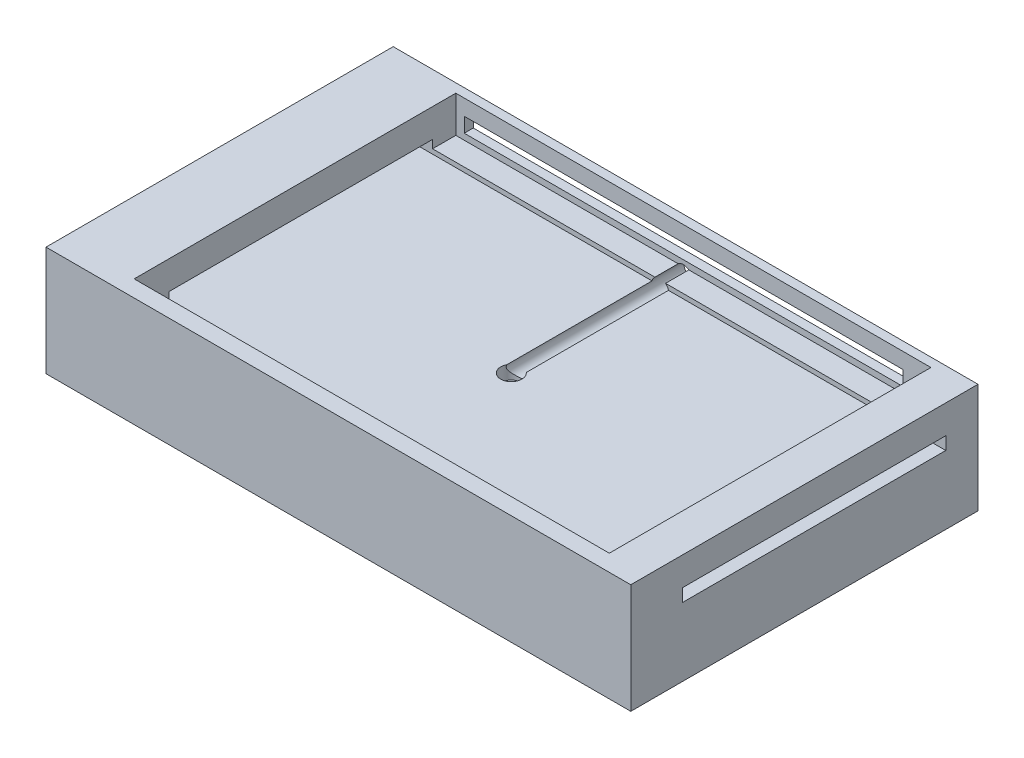
ISO-10303-21;
HEADER;
FILE_DESCRIPTION(('STEP AP214'),'2;1');
FILE_NAME('part.step','',(''),(''),'','','');
FILE_SCHEMA(('AUTOMOTIVE_DESIGN { 1 0 10303 214 1 1 1 1 }'));
ENDSEC;
DATA;
#1=APPLICATION_CONTEXT('core data for automotive mechanical design processes');
#2=APPLICATION_PROTOCOL_DEFINITION('international standard','automotive_design',2000,#1);
#3=PRODUCT_CONTEXT('',#1,'mechanical');
#4=PRODUCT('Part','Part','',(#3));
#5=PRODUCT_RELATED_PRODUCT_CATEGORY('part','',(#4));
#6=PRODUCT_DEFINITION_FORMATION('','',#4);
#7=PRODUCT_DEFINITION_CONTEXT('part definition',#1,'design');
#8=PRODUCT_DEFINITION('design','',#6,#7);
#9=PRODUCT_DEFINITION_SHAPE('','',#8);
#10=(LENGTH_UNIT() NAMED_UNIT(*) SI_UNIT(.MILLI.,.METRE.));
#11=(NAMED_UNIT(*) PLANE_ANGLE_UNIT() SI_UNIT($,.RADIAN.));
#12=(NAMED_UNIT(*) SI_UNIT($,.STERADIAN.) SOLID_ANGLE_UNIT());
#13=UNCERTAINTY_MEASURE_WITH_UNIT(LENGTH_MEASURE(1.E-05),#10,'distance_accuracy_value','');
#14=(GEOMETRIC_REPRESENTATION_CONTEXT(3) GLOBAL_UNCERTAINTY_ASSIGNED_CONTEXT((#13)) GLOBAL_UNIT_ASSIGNED_CONTEXT((#10,
#11,#12)) REPRESENTATION_CONTEXT('',''));
#15=CARTESIAN_POINT('',(0.,0.,0.));
#16=DIRECTION('',(0.,0.,1.));
#17=DIRECTION('',(1.,0.,0.));
#18=AXIS2_PLACEMENT_3D('',#15,#16,#17);
#19=CARTESIAN_POINT('',(0.,20.,0.));
#20=DIRECTION('',(0.,-1.,0.));
#21=DIRECTION('',(0.,0.,-1.));
#22=AXIS2_PLACEMENT_3D('',#19,#20,#21);
#23=PLANE('',#22);
#24=DIRECTION('',(1.,0.,0.));
#25=VECTOR('',#24,1.);
#26=CARTESIAN_POINT('',(0.,20.,-24.206272491128));
#27=LINE('',#26,#25);
#28=CARTESIAN_POINT('',(-60.6525714232133,20.,-24.206272491128));
#29=VERTEX_POINT('',#28);
#30=CARTESIAN_POINT('',(0.175411680552622,20.,-24.206272491128));
#31=VERTEX_POINT('',#30);
#32=EDGE_CURVE('E232',#29,#31,#27,.T.);
#33=ORIENTED_EDGE('',*,*,#32,.T.);
#34=DIRECTION('',(0.,0.,-1.));
#35=VECTOR('',#34,1.);
#36=CARTESIAN_POINT('',(0.175411680552622,20.,16.9774990782962));
#37=LINE('',#36,#35);
#38=CARTESIAN_POINT('',(0.175411680552622,20.,-30.5590778815483));
#39=VERTEX_POINT('',#38);
#40=EDGE_CURVE('E437',#31,#39,#37,.T.);
#41=ORIENTED_EDGE('',*,*,#40,.T.);
#42=DIRECTION('',(-1.,0.,0.));
#43=VECTOR('',#42,1.);
#44=CARTESIAN_POINT('',(-60.6525714232133,20.,-30.5590778815483));
#45=LINE('',#44,#43);
#46=CARTESIAN_POINT('',(-60.6525714232133,20.,-30.5590778815483));
#47=VERTEX_POINT('',#46);
#48=EDGE_CURVE('E338',#39,#47,#45,.T.);
#49=ORIENTED_EDGE('',*,*,#48,.T.);
#50=DIRECTION('',(0.,0.,1.));
#51=VECTOR('',#50,1.);
#52=CARTESIAN_POINT('',(-60.6525714232133,20.,57.4409221184517));
#53=LINE('',#52,#51);
#54=EDGE_CURVE('E329',#47,#29,#53,.T.);
#55=ORIENTED_EDGE('',*,*,#54,.T.);
#56=EDGE_LOOP('',(#33,#41,#49,#55));
#57=FACE_BOUND('',#56,.T.);
#58=ADVANCED_FACE('F39',(#57),#23,.F.);
#59=CARTESIAN_POINT('',(-80.2367335244583,22.2225688530647,-24.206272491128));
#60=DIRECTION('',(0.,0.,-1.));
#61=DIRECTION('',(-1.,0.,0.));
#62=AXIS2_PLACEMENT_3D('',#59,#60,#61);
#63=PLANE('',#62);
#64=DIRECTION('',(1.,0.,0.));
#65=VECTOR('',#64,1.);
#66=CARTESIAN_POINT('',(-80.2367335244583,18.7225688530647,-24.206272491128));
#67=LINE('',#66,#65);
#68=CARTESIAN_POINT('',(-80.2367335244583,18.7225688530647,-24.206272491128));
#69=VERTEX_POINT('',#68);
#70=CARTESIAN_POINT('',(-0.608205941388094,18.7225688530647,-24.206272491128));
#71=VERTEX_POINT('',#70);
#72=EDGE_CURVE('E397',#69,#71,#67,.T.);
#73=ORIENTED_EDGE('',*,*,#72,.T.);
#74=CARTESIAN_POINT('',(1.63716246487507,18.2242509624013,-24.206272491128));
#75=DIRECTION('',(0.,0.,-1.));
#76=DIRECTION('',(-1.,0.,0.));
#77=AXIS2_PLACEMENT_3D('',#74,#75,#76);
#78=CIRCLE('',#77,2.29999999999999);
#79=EDGE_CURVE('E219',#71,#31,#78,.T.);
#80=ORIENTED_EDGE('',*,*,#79,.T.);
#81=ORIENTED_EDGE('',*,*,#32,.F.);
#82=DIRECTION('',(0.,-1.,0.));
#83=VECTOR('',#82,1.);
#84=CARTESIAN_POINT('',(-60.6525714232133,20.,-24.206272491128));
#85=LINE('',#84,#83);
#86=CARTESIAN_POINT('',(-60.6525714232133,22.2225688530647,-24.206272491128));
#87=VERTEX_POINT('',#86);
#88=EDGE_CURVE('E386',#87,#29,#85,.T.);
#89=ORIENTED_EDGE('',*,*,#88,.F.);
#90=DIRECTION('',(1.,0.,0.));
#91=VECTOR('',#90,1.);
#92=CARTESIAN_POINT('',(-80.2367335244583,22.2225688530647,-24.206272491128));
#93=LINE('',#92,#91);
#94=CARTESIAN_POINT('',(-80.2367335244583,22.2225688530647,-24.206272491128));
#95=VERTEX_POINT('',#94);
#96=EDGE_CURVE('E401',#95,#87,#93,.T.);
#97=ORIENTED_EDGE('',*,*,#96,.F.);
#98=DIRECTION('',(0.,1.,0.));
#99=VECTOR('',#98,1.);
#100=CARTESIAN_POINT('',(-80.2367335244583,22.2225688530647,-24.206272491128));
#101=LINE('',#100,#99);
#102=EDGE_CURVE('E67',#69,#95,#101,.T.);
#103=ORIENTED_EDGE('',*,*,#102,.F.);
#104=EDGE_LOOP('',(#73,#80,#81,#89,#97,#103));
#105=FACE_BOUND('',#104,.T.);
#106=ADVANCED_FACE('F471',(#105),#63,.F.);
#107=DIRECTION('',(0.,0.,-1.));
#108=VECTOR('',#107,1.);
#109=CARTESIAN_POINT('',(69.3474285767867,20.,57.4409221184517));
#110=LINE('',#109,#108);
#111=CARTESIAN_POINT('',(69.3474285767867,20.,57.4409221184517));
#112=VERTEX_POINT('',#111);
#113=CARTESIAN_POINT('',(69.3474285767867,20.,47.853119348872));
#114=VERTEX_POINT('',#113);
#115=EDGE_CURVE('E339',#112,#114,#110,.T.);
#116=ORIENTED_EDGE('',*,*,#115,.T.);
#117=DIRECTION('',(-1.,0.,0.));
#118=VECTOR('',#117,1.);
#119=CARTESIAN_POINT('',(0.,20.,47.853119348872));
#120=LINE('',#119,#118);
#121=CARTESIAN_POINT('',(-60.6525714232133,20.,47.853119348872));
#122=VERTEX_POINT('',#121);
#123=EDGE_CURVE('E228',#114,#122,#120,.T.);
#124=ORIENTED_EDGE('',*,*,#123,.T.);
#125=CARTESIAN_POINT('',(-60.6525714232133,20.,57.4409221184517));
#126=VERTEX_POINT('',#125);
#127=EDGE_CURVE('E333',#122,#126,#53,.T.);
#128=ORIENTED_EDGE('',*,*,#127,.T.);
#129=DIRECTION('',(1.,0.,0.));
#130=VECTOR('',#129,1.);
#131=CARTESIAN_POINT('',(-60.6525714232133,20.,57.4409221184517));
#132=LINE('',#131,#130);
#133=EDGE_CURVE('E301',#126,#112,#132,.T.);
#134=ORIENTED_EDGE('',*,*,#133,.T.);
#135=EDGE_LOOP('',(#116,#124,#128,#134));
#136=FACE_BOUND('',#135,.T.);
#137=ADVANCED_FACE('F474',(#136),#23,.F.);
#138=CARTESIAN_POINT('',(-80.2367335244583,30.,-33.0225009217038));
#139=DIRECTION('',(1.,0.,0.));
#140=DIRECTION('',(0.,0.,-1.));
#141=AXIS2_PLACEMENT_3D('',#138,#139,#140);
#142=PLANE('',#141);
#143=DIRECTION('',(0.,0.,1.));
#144=VECTOR('',#143,1.);
#145=CARTESIAN_POINT('',(-80.2367335244583,22.2225688530647,47.853119348872));
#146=LINE('',#145,#144);
#147=CARTESIAN_POINT('',(-80.2367335244583,22.2225688530647,47.853119348872));
#148=VERTEX_POINT('',#147);
#149=EDGE_CURVE('E396',#95,#148,#146,.T.);
#150=ORIENTED_EDGE('',*,*,#149,.T.);
#151=DIRECTION('',(0.,-1.,0.));
#152=VECTOR('',#151,1.);
#153=CARTESIAN_POINT('',(-80.2367335244583,22.2225688530647,47.853119348872));
#154=LINE('',#153,#152);
#155=CARTESIAN_POINT('',(-80.2367335244583,18.7225688530647,47.853119348872));
#156=VERTEX_POINT('',#155);
#157=EDGE_CURVE('E418',#148,#156,#154,.T.);
#158=ORIENTED_EDGE('',*,*,#157,.T.);
#159=DIRECTION('',(0.,0.,-1.));
#160=VECTOR('',#159,1.);
#161=CARTESIAN_POINT('',(-80.2367335244583,18.7225688530647,47.853119348872));
#162=LINE('',#161,#160);
#163=EDGE_CURVE('E414',#156,#69,#162,.T.);
#164=ORIENTED_EDGE('',*,*,#163,.T.);
#165=ORIENTED_EDGE('',*,*,#102,.T.);
#166=EDGE_LOOP('',(#150,#158,#164,#165));
#167=FACE_BOUND('',#166,.T.);
#168=DIRECTION('',(0.,0.,1.));
#169=VECTOR('',#168,1.);
#170=CARTESIAN_POINT('',(-80.2367335244583,0.,-33.0225009217038));
#171=LINE('',#170,#169);
#172=CARTESIAN_POINT('',(-80.2367335244583,0.,-33.0225009217038));
#173=VERTEX_POINT('',#172);
#174=CARTESIAN_POINT('',(-80.2367335244583,0.,61.9774990782962));
#175=VERTEX_POINT('',#174);
#176=EDGE_CURVE('E280',#173,#175,#171,.T.);
#177=ORIENTED_EDGE('',*,*,#176,.T.);
#178=DIRECTION('',(0.,-1.,0.));
#179=VECTOR('',#178,1.);
#180=CARTESIAN_POINT('',(-80.2367335244583,30.,61.9774990782962));
#181=LINE('',#180,#179);
#182=CARTESIAN_POINT('',(-80.2367335244583,30.,61.9774990782962));
#183=VERTEX_POINT('',#182);
#184=EDGE_CURVE('E253',#183,#175,#181,.T.);
#185=ORIENTED_EDGE('',*,*,#184,.F.);
#186=DIRECTION('',(0.,0.,1.));
#187=VECTOR('',#186,1.);
#188=CARTESIAN_POINT('',(-80.2367335244583,30.,-33.0225009217038));
#189=LINE('',#188,#187);
#190=CARTESIAN_POINT('',(-80.2367335244583,30.,-33.0225009217038));
#191=VERTEX_POINT('',#190);
#192=EDGE_CURVE('E273',#191,#183,#189,.T.);
#193=ORIENTED_EDGE('',*,*,#192,.F.);
#194=DIRECTION('',(0.,-1.,0.));
#195=VECTOR('',#194,1.);
#196=CARTESIAN_POINT('',(-80.2367335244583,30.,-33.0225009217038));
#197=LINE('',#196,#195);
#198=EDGE_CURVE('E265',#191,#173,#197,.T.);
#199=ORIENTED_EDGE('',*,*,#198,.T.);
#200=EDGE_LOOP('',(#177,#185,#193,#199));
#201=FACE_BOUND('',#200,.T.);
#202=ADVANCED_FACE('F41',(#167,#201),#142,.F.);
#203=CARTESIAN_POINT('',(-80.2367335244583,30.,61.9774990782962));
#204=DIRECTION('',(0.,0.,-1.));
#205=DIRECTION('',(-1.,0.,0.));
#206=AXIS2_PLACEMENT_3D('',#203,#204,#205);
#207=PLANE('',#206);
#208=DIRECTION('',(1.,0.,0.));
#209=VECTOR('',#208,1.);
#210=CARTESIAN_POINT('',(-80.2367335244583,0.,61.9774990782962));
#211=LINE('',#210,#209);
#212=CARTESIAN_POINT('',(79.7632664755417,0.,61.9774990782962));
#213=VERTEX_POINT('',#212);
#214=EDGE_CURVE('E277',#175,#213,#211,.T.);
#215=ORIENTED_EDGE('',*,*,#214,.T.);
#216=DIRECTION('',(0.,-1.,0.));
#217=VECTOR('',#216,1.);
#218=CARTESIAN_POINT('',(79.7632664755417,30.,61.9774990782962));
#219=LINE('',#218,#217);
#220=CARTESIAN_POINT('',(79.7632664755417,30.,61.9774990782962));
#221=VERTEX_POINT('',#220);
#222=EDGE_CURVE('E257',#221,#213,#219,.T.);
#223=ORIENTED_EDGE('',*,*,#222,.F.);
#224=DIRECTION('',(1.,0.,0.));
#225=VECTOR('',#224,1.);
#226=CARTESIAN_POINT('',(-80.2367335244583,30.,61.9774990782962));
#227=LINE('',#226,#225);
#228=EDGE_CURVE('E290',#183,#221,#227,.T.);
#229=ORIENTED_EDGE('',*,*,#228,.F.);
#230=ORIENTED_EDGE('',*,*,#184,.T.);
#231=EDGE_LOOP('',(#215,#223,#229,#230));
#232=FACE_BOUND('',#231,.T.);
#233=ADVANCED_FACE('F602',(#232),#207,.F.);
#234=CARTESIAN_POINT('',(79.7632664755417,30.,-33.0225009217038));
#235=DIRECTION('',(-1.,0.,0.));
#236=DIRECTION('',(0.,0.,1.));
#237=AXIS2_PLACEMENT_3D('',#234,#235,#236);
#238=PLANE('',#237);
#239=DIRECTION('',(0.,0.,-1.));
#240=VECTOR('',#239,1.);
#241=CARTESIAN_POINT('',(79.7632664755417,18.7225688530647,47.853119348872));
#242=LINE('',#241,#240);
#243=CARTESIAN_POINT('',(79.7632664755417,18.7225688530647,47.853119348872));
#244=VERTEX_POINT('',#243);
#245=CARTESIAN_POINT('',(79.7632664755417,18.7225688530647,-24.206272491128));
#246=VERTEX_POINT('',#245);
#247=EDGE_CURVE('E430',#244,#246,#242,.T.);
#248=ORIENTED_EDGE('',*,*,#247,.F.);
#249=DIRECTION('',(0.,-1.,0.));
#250=VECTOR('',#249,1.);
#251=CARTESIAN_POINT('',(79.7632664755417,22.2225688530647,47.853119348872));
#252=LINE('',#251,#250);
#253=CARTESIAN_POINT('',(79.7632664755417,22.2225688530647,47.853119348872));
#254=VERTEX_POINT('',#253);
#255=EDGE_CURVE('E434',#254,#244,#252,.T.);
#256=ORIENTED_EDGE('',*,*,#255,.F.);
#257=DIRECTION('',(0.,0.,1.));
#258=VECTOR('',#257,1.);
#259=CARTESIAN_POINT('',(79.7632664755417,22.2225688530647,47.853119348872));
#260=LINE('',#259,#258);
#261=CARTESIAN_POINT('',(79.7632664755417,22.2225688530647,-24.206272491128));
#262=VERTEX_POINT('',#261);
#263=EDGE_CURVE('E422',#262,#254,#260,.T.);
#264=ORIENTED_EDGE('',*,*,#263,.F.);
#265=DIRECTION('',(0.,1.,0.));
#266=VECTOR('',#265,1.);
#267=CARTESIAN_POINT('',(79.7632664755417,22.2225688530647,-24.206272491128));
#268=LINE('',#267,#266);
#269=EDGE_CURVE('E426',#246,#262,#268,.T.);
#270=ORIENTED_EDGE('',*,*,#269,.F.);
#271=EDGE_LOOP('',(#248,#256,#264,#270));
#272=FACE_BOUND('',#271,.T.);
#273=DIRECTION('',(0.,0.,-1.));
#274=VECTOR('',#273,1.);
#275=CARTESIAN_POINT('',(79.7632664755417,0.,-33.0225009217038));
#276=LINE('',#275,#274);
#277=CARTESIAN_POINT('',(79.7632664755417,0.,-33.0225009217038));
#278=VERTEX_POINT('',#277);
#279=EDGE_CURVE('E274',#213,#278,#276,.T.);
#280=ORIENTED_EDGE('',*,*,#279,.T.);
#281=DIRECTION('',(0.,-1.,0.));
#282=VECTOR('',#281,1.);
#283=CARTESIAN_POINT('',(79.7632664755417,30.,-33.0225009217038));
#284=LINE('',#283,#282);
#285=CARTESIAN_POINT('',(79.7632664755417,30.,-33.0225009217038));
#286=VERTEX_POINT('',#285);
#287=EDGE_CURVE('E261',#286,#278,#284,.T.);
#288=ORIENTED_EDGE('',*,*,#287,.F.);
#289=DIRECTION('',(0.,0.,-1.));
#290=VECTOR('',#289,1.);
#291=CARTESIAN_POINT('',(79.7632664755417,30.,-33.0225009217038));
#292=LINE('',#291,#290);
#293=EDGE_CURVE('E287',#221,#286,#292,.T.);
#294=ORIENTED_EDGE('',*,*,#293,.F.);
#295=ORIENTED_EDGE('',*,*,#222,.T.);
#296=EDGE_LOOP('',(#280,#288,#294,#295));
#297=FACE_BOUND('',#296,.T.);
#298=ADVANCED_FACE('F522',(#272,#297),#238,.F.);
#299=CARTESIAN_POINT('',(-80.2367335244583,30.,-33.0225009217038));
#300=DIRECTION('',(0.,0.,1.));
#301=DIRECTION('',(1.,0.,0.));
#302=AXIS2_PLACEMENT_3D('',#299,#300,#301);
#303=PLANE('',#302);
#304=CARTESIAN_POINT('',(1.63716246487507,18.2242509624013,-33.0225009217038));
#305=DIRECTION('',(0.,0.,-1.));
#306=DIRECTION('',(-1.,0.,0.));
#307=AXIS2_PLACEMENT_3D('',#304,#305,#306);
#308=CIRCLE('',#307,2.29999999999999);
#309=CARTESIAN_POINT('',(-0.662837535124927,18.2242509624013,-33.0225009217038));
#310=VERTEX_POINT('',#309);
#311=EDGE_CURVE('E214',#310,#310,#308,.T.);
#312=ORIENTED_EDGE('',*,*,#311,.F.);
#313=EDGE_LOOP('',(#312));
#314=FACE_BOUND('',#313,.T.);
#315=DIRECTION('',(1.,0.,0.));
#316=VECTOR('',#315,1.);
#317=CARTESIAN_POINT('',(61.7740290813717,25.6912352436837,-33.0225009217038));
#318=LINE('',#317,#316);
#319=CARTESIAN_POINT('',(-58.3343159686283,25.6912352436837,-33.0225009217038));
#320=VERTEX_POINT('',#319);
#321=CARTESIAN_POINT('',(61.7740290813717,25.6912352436837,-33.0225009217038));
#322=VERTEX_POINT('',#321);
#323=EDGE_CURVE('E363',#320,#322,#318,.T.);
#324=ORIENTED_EDGE('',*,*,#323,.F.);
#325=DIRECTION('',(0.,1.,0.));
#326=VECTOR('',#325,1.);
#327=CARTESIAN_POINT('',(-58.3343159686283,21.6735017236837,-33.0225009217038));
#328=LINE('',#327,#326);
#329=CARTESIAN_POINT('',(-58.3343159686283,21.6735017236837,-33.0225009217038));
#330=VERTEX_POINT('',#329);
#331=EDGE_CURVE('E367',#330,#320,#328,.T.);
#332=ORIENTED_EDGE('',*,*,#331,.F.);
#333=DIRECTION('',(-1.,0.,0.));
#334=VECTOR('',#333,1.);
#335=CARTESIAN_POINT('',(61.7740290813717,21.6735017236837,-33.0225009217038));
#336=LINE('',#335,#334);
#337=CARTESIAN_POINT('',(61.7740290813717,21.6735017236837,-33.0225009217038));
#338=VERTEX_POINT('',#337);
#339=EDGE_CURVE('E348',#338,#330,#336,.T.);
#340=ORIENTED_EDGE('',*,*,#339,.F.);
#341=DIRECTION('',(0.,-1.,0.));
#342=VECTOR('',#341,1.);
#343=CARTESIAN_POINT('',(61.7740290813717,21.6735017236837,-33.0225009217038));
#344=LINE('',#343,#342);
#345=EDGE_CURVE('E359',#322,#338,#344,.T.);
#346=ORIENTED_EDGE('',*,*,#345,.F.);
#347=EDGE_LOOP('',(#324,#332,#340,#346));
#348=FACE_BOUND('',#347,.T.);
#349=DIRECTION('',(-1.,0.,0.));
#350=VECTOR('',#349,1.);
#351=CARTESIAN_POINT('',(-80.2367335244583,0.,-33.0225009217038));
#352=LINE('',#351,#350);
#353=EDGE_CURVE('E270',#278,#173,#352,.T.);
#354=ORIENTED_EDGE('',*,*,#353,.T.);
#355=ORIENTED_EDGE('',*,*,#198,.F.);
#356=DIRECTION('',(-1.,0.,0.));
#357=VECTOR('',#356,1.);
#358=CARTESIAN_POINT('',(-80.2367335244583,30.,-33.0225009217038));
#359=LINE('',#358,#357);
#360=EDGE_CURVE('E269',#286,#191,#359,.T.);
#361=ORIENTED_EDGE('',*,*,#360,.F.);
#362=ORIENTED_EDGE('',*,*,#287,.T.);
#363=EDGE_LOOP('',(#354,#355,#361,#362));
#364=FACE_BOUND('',#363,.T.);
#365=ADVANCED_FACE('F584',(#314,#348,#364),#303,.F.);
#366=CARTESIAN_POINT('',(0.,30.,0.));
#367=DIRECTION('',(0.,1.,0.));
#368=DIRECTION('',(0.,0.,1.));
#369=AXIS2_PLACEMENT_3D('',#366,#367,#368);
#370=PLANE('',#369);
#371=DIRECTION('',(0.,0.,-1.));
#372=VECTOR('',#371,1.);
#373=CARTESIAN_POINT('',(69.3474285767867,30.,57.4409221184517));
#374=LINE('',#373,#372);
#375=CARTESIAN_POINT('',(69.3474285767867,30.,57.4409221184517));
#376=VERTEX_POINT('',#375);
#377=CARTESIAN_POINT('',(69.3474285767867,30.,-30.5590778815483));
#378=VERTEX_POINT('',#377);
#379=EDGE_CURVE('E322',#376,#378,#374,.T.);
#380=ORIENTED_EDGE('',*,*,#379,.F.);
#381=DIRECTION('',(1.,0.,0.));
#382=VECTOR('',#381,1.);
#383=CARTESIAN_POINT('',(-60.6525714232133,30.,57.4409221184517));
#384=LINE('',#383,#382);
#385=CARTESIAN_POINT('',(-60.6525714232133,30.,57.4409221184517));
#386=VERTEX_POINT('',#385);
#387=EDGE_CURVE('E309',#386,#376,#384,.T.);
#388=ORIENTED_EDGE('',*,*,#387,.F.);
#389=DIRECTION('',(0.,0.,1.));
#390=VECTOR('',#389,1.);
#391=CARTESIAN_POINT('',(-60.6525714232133,30.,57.4409221184517));
#392=LINE('',#391,#390);
#393=CARTESIAN_POINT('',(-60.6525714232133,30.,-30.5590778815483));
#394=VERTEX_POINT('',#393);
#395=EDGE_CURVE('E314',#394,#386,#392,.T.);
#396=ORIENTED_EDGE('',*,*,#395,.F.);
#397=DIRECTION('',(-1.,0.,0.));
#398=VECTOR('',#397,1.);
#399=CARTESIAN_POINT('',(-60.6525714232133,30.,-30.5590778815483));
#400=LINE('',#399,#398);
#401=EDGE_CURVE('E318',#378,#394,#400,.T.);
#402=ORIENTED_EDGE('',*,*,#401,.F.);
#403=EDGE_LOOP('',(#380,#388,#396,#402));
#404=FACE_BOUND('',#403,.T.);
#405=ORIENTED_EDGE('',*,*,#192,.T.);
#406=ORIENTED_EDGE('',*,*,#228,.T.);
#407=ORIENTED_EDGE('',*,*,#293,.T.);
#408=ORIENTED_EDGE('',*,*,#360,.T.);
#409=EDGE_LOOP('',(#405,#406,#407,#408));
#410=FACE_BOUND('',#409,.T.);
#411=ADVANCED_FACE('F542',(#404,#410),#370,.T.);
#412=CARTESIAN_POINT('',(0.,0.,0.));
#413=DIRECTION('',(0.,1.,0.));
#414=DIRECTION('',(0.,0.,1.));
#415=AXIS2_PLACEMENT_3D('',#412,#413,#414);
#416=PLANE('',#415);
#417=ORIENTED_EDGE('',*,*,#176,.F.);
#418=ORIENTED_EDGE('',*,*,#353,.F.);
#419=ORIENTED_EDGE('',*,*,#279,.F.);
#420=ORIENTED_EDGE('',*,*,#214,.F.);
#421=EDGE_LOOP('',(#417,#418,#419,#420));
#422=FACE_BOUND('',#421,.T.);
#423=ADVANCED_FACE('F599',(#422),#416,.F.);
#424=CARTESIAN_POINT('',(69.3474285767867,20.,57.4409221184517));
#425=DIRECTION('',(1.,0.,0.));
#426=DIRECTION('',(0.,0.,-1.));
#427=AXIS2_PLACEMENT_3D('',#424,#425,#426);
#428=PLANE('',#427);
#429=DIRECTION('',(0.,0.,1.));
#430=VECTOR('',#429,1.);
#431=CARTESIAN_POINT('',(69.3474285767867,22.2225688530647,57.4409221184517));
#432=LINE('',#431,#430);
#433=CARTESIAN_POINT('',(69.3474285767867,22.2225688530647,-24.206272491128));
#434=VERTEX_POINT('',#433);
#435=CARTESIAN_POINT('',(69.3474285767867,22.2225688530647,47.853119348872));
#436=VERTEX_POINT('',#435);
#437=EDGE_CURVE('E370',#434,#436,#432,.T.);
#438=ORIENTED_EDGE('',*,*,#437,.T.);
#439=DIRECTION('',(0.,-1.,0.));
#440=VECTOR('',#439,1.);
#441=CARTESIAN_POINT('',(69.3474285767867,20.,47.853119348872));
#442=LINE('',#441,#440);
#443=EDGE_CURVE('E374',#436,#114,#442,.T.);
#444=ORIENTED_EDGE('',*,*,#443,.T.);
#445=ORIENTED_EDGE('',*,*,#115,.F.);
#446=DIRECTION('',(0.,1.,0.));
#447=VECTOR('',#446,1.);
#448=CARTESIAN_POINT('',(69.3474285767867,20.,57.4409221184517));
#449=LINE('',#448,#447);
#450=EDGE_CURVE('E284',#112,#376,#449,.T.);
#451=ORIENTED_EDGE('',*,*,#450,.T.);
#452=ORIENTED_EDGE('',*,*,#379,.T.);
#453=DIRECTION('',(0.,1.,0.));
#454=VECTOR('',#453,1.);
#455=CARTESIAN_POINT('',(69.3474285767867,20.,-30.5590778815483));
#456=LINE('',#455,#454);
#457=CARTESIAN_POINT('',(69.3474285767867,20.,-30.5590778815483));
#458=VERTEX_POINT('',#457);
#459=EDGE_CURVE('E296',#458,#378,#456,.T.);
#460=ORIENTED_EDGE('',*,*,#459,.F.);
#461=CARTESIAN_POINT('',(69.3474285767867,20.,-24.206272491128));
#462=VERTEX_POINT('',#461);
#463=EDGE_CURVE('E313',#462,#458,#110,.T.);
#464=ORIENTED_EDGE('',*,*,#463,.F.);
#465=DIRECTION('',(0.,1.,0.));
#466=VECTOR('',#465,1.);
#467=CARTESIAN_POINT('',(69.3474285767867,20.,-24.206272491128));
#468=LINE('',#467,#466);
#469=EDGE_CURVE('E382',#462,#434,#468,.T.);
#470=ORIENTED_EDGE('',*,*,#469,.T.);
#471=EDGE_LOOP('',(#438,#444,#445,#451,#452,#460,#464,#470));
#472=FACE_BOUND('',#471,.T.);
#473=ADVANCED_FACE('F537',(#472),#428,.F.);
#474=CARTESIAN_POINT('',(-60.6525714232133,20.,57.4409221184517));
#475=DIRECTION('',(0.,0.,1.));
#476=DIRECTION('',(1.,0.,0.));
#477=AXIS2_PLACEMENT_3D('',#474,#475,#476);
#478=PLANE('',#477);
#479=ORIENTED_EDGE('',*,*,#387,.T.);
#480=ORIENTED_EDGE('',*,*,#450,.F.);
#481=ORIENTED_EDGE('',*,*,#133,.F.);
#482=DIRECTION('',(0.,1.,0.));
#483=VECTOR('',#482,1.);
#484=CARTESIAN_POINT('',(-60.6525714232133,20.,57.4409221184517));
#485=LINE('',#484,#483);
#486=EDGE_CURVE('E304',#126,#386,#485,.T.);
#487=ORIENTED_EDGE('',*,*,#486,.T.);
#488=EDGE_LOOP('',(#479,#480,#481,#487));
#489=FACE_BOUND('',#488,.T.);
#490=ADVANCED_FACE('F548',(#489),#478,.F.);
#491=CARTESIAN_POINT('',(-60.6525714232133,20.,57.4409221184517));
#492=DIRECTION('',(-1.,0.,0.));
#493=DIRECTION('',(0.,0.,1.));
#494=AXIS2_PLACEMENT_3D('',#491,#492,#493);
#495=PLANE('',#494);
#496=ORIENTED_EDGE('',*,*,#127,.F.);
#497=DIRECTION('',(0.,1.,0.));
#498=VECTOR('',#497,1.);
#499=CARTESIAN_POINT('',(-60.6525714232133,20.,47.853119348872));
#500=LINE('',#499,#498);
#501=CARTESIAN_POINT('',(-60.6525714232133,22.2225688530647,47.853119348872));
#502=VERTEX_POINT('',#501);
#503=EDGE_CURVE('E378',#122,#502,#500,.T.);
#504=ORIENTED_EDGE('',*,*,#503,.T.);
#505=DIRECTION('',(0.,0.,-1.));
#506=VECTOR('',#505,1.);
#507=CARTESIAN_POINT('',(-60.6525714232133,22.2225688530647,57.4409221184517));
#508=LINE('',#507,#506);
#509=EDGE_CURVE('E222',#502,#87,#508,.T.);
#510=ORIENTED_EDGE('',*,*,#509,.T.);
#511=ORIENTED_EDGE('',*,*,#88,.T.);
#512=ORIENTED_EDGE('',*,*,#54,.F.);
#513=DIRECTION('',(0.,1.,0.));
#514=VECTOR('',#513,1.);
#515=CARTESIAN_POINT('',(-60.6525714232133,20.,-30.5590778815483));
#516=LINE('',#515,#514);
#517=EDGE_CURVE('E300',#47,#394,#516,.T.);
#518=ORIENTED_EDGE('',*,*,#517,.T.);
#519=ORIENTED_EDGE('',*,*,#395,.T.);
#520=ORIENTED_EDGE('',*,*,#486,.F.);
#521=EDGE_LOOP('',(#496,#504,#510,#511,#512,#518,#519,#520));
#522=FACE_BOUND('',#521,.T.);
#523=ADVANCED_FACE('F495',(#522),#495,.F.);
#524=CARTESIAN_POINT('',(-60.6525714232133,20.,-30.5590778815483));
#525=DIRECTION('',(0.,0.,-1.));
#526=DIRECTION('',(-1.,0.,0.));
#527=AXIS2_PLACEMENT_3D('',#524,#525,#526);
#528=PLANE('',#527);
#529=DIRECTION('',(-1.,0.,0.));
#530=VECTOR('',#529,1.);
#531=CARTESIAN_POINT('',(-60.6525714232133,21.6735017236837,-30.5590778815483));
#532=LINE('',#531,#530);
#533=CARTESIAN_POINT('',(61.7740290813717,21.6735017236837,-30.5590778815483));
#534=VERTEX_POINT('',#533);
#535=CARTESIAN_POINT('',(-58.3343159686283,21.6735017236837,-30.5590778815483));
#536=VERTEX_POINT('',#535);
#537=EDGE_CURVE('E241',#534,#536,#532,.T.);
#538=ORIENTED_EDGE('',*,*,#537,.T.);
#539=DIRECTION('',(0.,1.,0.));
#540=VECTOR('',#539,1.);
#541=CARTESIAN_POINT('',(-58.3343159686283,20.,-30.5590778815483));
#542=LINE('',#541,#540);
#543=CARTESIAN_POINT('',(-58.3343159686283,25.6912352436837,-30.5590778815483));
#544=VERTEX_POINT('',#543);
#545=EDGE_CURVE('E237',#536,#544,#542,.T.);
#546=ORIENTED_EDGE('',*,*,#545,.T.);
#547=DIRECTION('',(1.,0.,0.));
#548=VECTOR('',#547,1.);
#549=CARTESIAN_POINT('',(-60.6525714232133,25.6912352436837,-30.5590778815483));
#550=LINE('',#549,#548);
#551=CARTESIAN_POINT('',(61.7740290813717,25.6912352436837,-30.5590778815483));
#552=VERTEX_POINT('',#551);
#553=EDGE_CURVE('E249',#544,#552,#550,.T.);
#554=ORIENTED_EDGE('',*,*,#553,.T.);
#555=DIRECTION('',(0.,-1.,0.));
#556=VECTOR('',#555,1.);
#557=CARTESIAN_POINT('',(61.7740290813717,20.,-30.5590778815483));
#558=LINE('',#557,#556);
#559=EDGE_CURVE('E245',#552,#534,#558,.T.);
#560=ORIENTED_EDGE('',*,*,#559,.T.);
#561=EDGE_LOOP('',(#538,#546,#554,#560));
#562=FACE_BOUND('',#561,.T.);
#563=ORIENTED_EDGE('',*,*,#48,.F.);
#564=CARTESIAN_POINT('',(1.63716246487507,18.2242509624013,-30.5590778815483));
#565=DIRECTION('',(0.,0.,-1.));
#566=DIRECTION('',(-1.,0.,0.));
#567=AXIS2_PLACEMENT_3D('',#564,#565,#566);
#568=CIRCLE('',#567,2.29999999999999);
#569=CARTESIAN_POINT('',(3.09891324919751,20.,-30.5590778815483));
#570=VERTEX_POINT('',#569);
#571=EDGE_CURVE('E441',#39,#570,#568,.T.);
#572=ORIENTED_EDGE('',*,*,#571,.T.);
#573=EDGE_CURVE('E334',#458,#570,#45,.T.);
#574=ORIENTED_EDGE('',*,*,#573,.F.);
#575=ORIENTED_EDGE('',*,*,#459,.T.);
#576=ORIENTED_EDGE('',*,*,#401,.T.);
#577=ORIENTED_EDGE('',*,*,#517,.F.);
#578=EDGE_LOOP('',(#563,#572,#574,#575,#576,#577));
#579=FACE_BOUND('',#578,.T.);
#580=ADVANCED_FACE('F487',(#562,#579),#528,.F.);
#581=ORIENTED_EDGE('',*,*,#573,.T.);
#582=DIRECTION('',(0.,0.,-1.));
#583=VECTOR('',#582,1.);
#584=CARTESIAN_POINT('',(3.09891324919751,20.,16.9774990782962));
#585=LINE('',#584,#583);
#586=CARTESIAN_POINT('',(3.09891324919751,20.,-24.206272491128));
#587=VERTEX_POINT('',#586);
#588=EDGE_CURVE('E445',#570,#587,#585,.F.);
#589=ORIENTED_EDGE('',*,*,#588,.T.);
#590=EDGE_CURVE('E236',#587,#462,#27,.T.);
#591=ORIENTED_EDGE('',*,*,#590,.T.);
#592=ORIENTED_EDGE('',*,*,#463,.T.);
#593=EDGE_LOOP('',(#581,#589,#591,#592));
#594=FACE_BOUND('',#593,.T.);
#595=ADVANCED_FACE('F475',(#594),#23,.F.);
#596=CARTESIAN_POINT('',(-58.3343159686283,21.6735017236837,-28.0225009217038));
#597=DIRECTION('',(-1.,0.,0.));
#598=DIRECTION('',(0.,0.,1.));
#599=AXIS2_PLACEMENT_3D('',#596,#597,#598);
#600=PLANE('',#599);
#601=DIRECTION('',(0.,0.,-1.));
#602=VECTOR('',#601,1.);
#603=CARTESIAN_POINT('',(-58.3343159686283,21.6735017236837,-28.0225009217038));
#604=LINE('',#603,#602);
#605=EDGE_CURVE('E325',#536,#330,#604,.T.);
#606=ORIENTED_EDGE('',*,*,#605,.T.);
#607=ORIENTED_EDGE('',*,*,#331,.T.);
#608=DIRECTION('',(0.,0.,-1.));
#609=VECTOR('',#608,1.);
#610=CARTESIAN_POINT('',(-58.3343159686283,25.6912352436837,-28.0225009217038));
#611=LINE('',#610,#609);
#612=EDGE_CURVE('E343',#544,#320,#611,.T.);
#613=ORIENTED_EDGE('',*,*,#612,.F.);
#614=ORIENTED_EDGE('',*,*,#545,.F.);
#615=EDGE_LOOP('',(#606,#607,#613,#614));
#616=FACE_BOUND('',#615,.T.);
#617=ADVANCED_FACE('F486',(#616),#600,.F.);
#618=CARTESIAN_POINT('',(61.7740290813717,21.6735017236837,-28.0225009217038));
#619=DIRECTION('',(0.,-1.,0.));
#620=DIRECTION('',(0.,0.,-1.));
#621=AXIS2_PLACEMENT_3D('',#618,#619,#620);
#622=PLANE('',#621);
#623=DIRECTION('',(0.,0.,-1.));
#624=VECTOR('',#623,1.);
#625=CARTESIAN_POINT('',(61.7740290813717,21.6735017236837,-28.0225009217038));
#626=LINE('',#625,#624);
#627=EDGE_CURVE('E351',#534,#338,#626,.T.);
#628=ORIENTED_EDGE('',*,*,#627,.T.);
#629=ORIENTED_EDGE('',*,*,#339,.T.);
#630=ORIENTED_EDGE('',*,*,#605,.F.);
#631=ORIENTED_EDGE('',*,*,#537,.F.);
#632=EDGE_LOOP('',(#628,#629,#630,#631));
#633=FACE_BOUND('',#632,.T.);
#634=ADVANCED_FACE('F493',(#633),#622,.F.);
#635=CARTESIAN_POINT('',(61.7740290813717,21.6735017236837,-28.0225009217038));
#636=DIRECTION('',(1.,0.,0.));
#637=DIRECTION('',(0.,0.,-1.));
#638=AXIS2_PLACEMENT_3D('',#635,#636,#637);
#639=PLANE('',#638);
#640=DIRECTION('',(0.,0.,-1.));
#641=VECTOR('',#640,1.);
#642=CARTESIAN_POINT('',(61.7740290813717,25.6912352436837,-28.0225009217038));
#643=LINE('',#642,#641);
#644=EDGE_CURVE('E347',#552,#322,#643,.T.);
#645=ORIENTED_EDGE('',*,*,#644,.T.);
#646=ORIENTED_EDGE('',*,*,#345,.T.);
#647=ORIENTED_EDGE('',*,*,#627,.F.);
#648=ORIENTED_EDGE('',*,*,#559,.F.);
#649=EDGE_LOOP('',(#645,#646,#647,#648));
#650=FACE_BOUND('',#649,.T.);
#651=ADVANCED_FACE('F559',(#650),#639,.F.);
#652=CARTESIAN_POINT('',(61.7740290813717,25.6912352436837,-28.0225009217038));
#653=DIRECTION('',(0.,1.,0.));
#654=DIRECTION('',(0.,0.,1.));
#655=AXIS2_PLACEMENT_3D('',#652,#653,#654);
#656=PLANE('',#655);
#657=ORIENTED_EDGE('',*,*,#612,.T.);
#658=ORIENTED_EDGE('',*,*,#323,.T.);
#659=ORIENTED_EDGE('',*,*,#644,.F.);
#660=ORIENTED_EDGE('',*,*,#553,.F.);
#661=EDGE_LOOP('',(#657,#658,#659,#660));
#662=FACE_BOUND('',#661,.T.);
#663=ADVANCED_FACE('F553',(#662),#656,.F.);
#664=CARTESIAN_POINT('',(-80.2367335244583,22.2225688530647,47.853119348872));
#665=DIRECTION('',(0.,1.,0.));
#666=DIRECTION('',(0.,0.,1.));
#667=AXIS2_PLACEMENT_3D('',#664,#665,#666);
#668=PLANE('',#667);
#669=EDGE_CURVE('E400',#434,#262,#93,.T.);
#670=ORIENTED_EDGE('',*,*,#669,.T.);
#671=ORIENTED_EDGE('',*,*,#263,.T.);
#672=DIRECTION('',(1.,0.,0.));
#673=VECTOR('',#672,1.);
#674=CARTESIAN_POINT('',(-80.2367335244583,22.2225688530647,47.853119348872));
#675=LINE('',#674,#673);
#676=EDGE_CURVE('E405',#436,#254,#675,.T.);
#677=ORIENTED_EDGE('',*,*,#676,.F.);
#678=ORIENTED_EDGE('',*,*,#437,.F.);
#679=EDGE_LOOP('',(#670,#671,#677,#678));
#680=FACE_BOUND('',#679,.T.);
#681=ADVANCED_FACE('F551',(#680),#668,.F.);
#682=EDGE_CURVE('E390',#148,#502,#675,.T.);
#683=ORIENTED_EDGE('',*,*,#682,.F.);
#684=ORIENTED_EDGE('',*,*,#149,.F.);
#685=ORIENTED_EDGE('',*,*,#96,.T.);
#686=ORIENTED_EDGE('',*,*,#509,.F.);
#687=EDGE_LOOP('',(#683,#684,#685,#686));
#688=FACE_BOUND('',#687,.T.);
#689=ADVANCED_FACE('F510',(#688),#668,.F.);
#690=CARTESIAN_POINT('',(-80.2367335244583,22.2225688530647,47.853119348872));
#691=DIRECTION('',(0.,0.,1.));
#692=DIRECTION('',(1.,0.,0.));
#693=AXIS2_PLACEMENT_3D('',#690,#691,#692);
#694=PLANE('',#693);
#695=ORIENTED_EDGE('',*,*,#676,.T.);
#696=ORIENTED_EDGE('',*,*,#255,.T.);
#697=DIRECTION('',(1.,0.,0.));
#698=VECTOR('',#697,1.);
#699=CARTESIAN_POINT('',(-80.2367335244583,18.7225688530647,47.853119348872));
#700=LINE('',#699,#698);
#701=EDGE_CURVE('E391',#156,#244,#700,.T.);
#702=ORIENTED_EDGE('',*,*,#701,.F.);
#703=ORIENTED_EDGE('',*,*,#157,.F.);
#704=ORIENTED_EDGE('',*,*,#682,.T.);
#705=ORIENTED_EDGE('',*,*,#503,.F.);
#706=ORIENTED_EDGE('',*,*,#123,.F.);
#707=ORIENTED_EDGE('',*,*,#443,.F.);
#708=EDGE_LOOP('',(#695,#696,#702,#703,#704,#705,#706,#707));
#709=FACE_BOUND('',#708,.T.);
#710=ADVANCED_FACE('F514',(#709),#694,.F.);
#711=ORIENTED_EDGE('',*,*,#590,.F.);
#712=CARTESIAN_POINT('',(3.88253087113823,18.7225688530647,-24.206272491128));
#713=VERTEX_POINT('',#712);
#714=EDGE_CURVE('E449',#587,#713,#78,.T.);
#715=ORIENTED_EDGE('',*,*,#714,.T.);
#716=EDGE_CURVE('E395',#713,#246,#67,.T.);
#717=ORIENTED_EDGE('',*,*,#716,.T.);
#718=ORIENTED_EDGE('',*,*,#269,.T.);
#719=ORIENTED_EDGE('',*,*,#669,.F.);
#720=ORIENTED_EDGE('',*,*,#469,.F.);
#721=EDGE_LOOP('',(#711,#715,#717,#718,#719,#720));
#722=FACE_BOUND('',#721,.T.);
#723=ADVANCED_FACE('F480',(#722),#63,.F.);
#724=CARTESIAN_POINT('',(-80.2367335244583,18.7225688530647,47.853119348872));
#725=DIRECTION('',(0.,-1.,0.));
#726=DIRECTION('',(0.,0.,-1.));
#727=AXIS2_PLACEMENT_3D('',#724,#725,#726);
#728=PLANE('',#727);
#729=DIRECTION('',(0.,0.,-1.));
#730=VECTOR('',#729,1.);
#731=CARTESIAN_POINT('',(3.88253087113823,18.7225688530647,16.9774990782962));
#732=LINE('',#731,#730);
#733=CARTESIAN_POINT('',(3.88253087113823,18.7225688530647,14.688797048188));
#734=VERTEX_POINT('',#733);
#735=EDGE_CURVE('E212',#713,#734,#732,.F.);
#736=ORIENTED_EDGE('',*,*,#735,.T.);
#737=CARTESIAN_POINT('',(1.96649265215023,18.7225688530647,16.8752292751281));
#738=DIRECTION('',(0.,-1.,0.));
#739=DIRECTION('',(0.,0.,-1.));
#740=AXIS2_PLACEMENT_3D('',#737,#738,#739);
#741=CIRCLE('',#740,2.90717875948916);
#742=CARTESIAN_POINT('',(-0.60820594138842,18.7225688530652,15.5251865009705));
#743=VERTEX_POINT('',#742);
#744=EDGE_CURVE('E60',#734,#743,#741,.T.);
#745=ORIENTED_EDGE('',*,*,#744,.T.);
#746=DIRECTION('',(0.,0.,-1.));
#747=VECTOR('',#746,1.);
#748=CARTESIAN_POINT('',(-0.608205941388094,18.7225688530647,16.9774990782962));
#749=LINE('',#748,#747);
#750=EDGE_CURVE('E54',#743,#71,#749,.T.);
#751=ORIENTED_EDGE('',*,*,#750,.T.);
#752=ORIENTED_EDGE('',*,*,#72,.F.);
#753=ORIENTED_EDGE('',*,*,#163,.F.);
#754=ORIENTED_EDGE('',*,*,#701,.T.);
#755=ORIENTED_EDGE('',*,*,#247,.T.);
#756=ORIENTED_EDGE('',*,*,#716,.F.);
#757=EDGE_LOOP('',(#736,#745,#751,#752,#753,#754,#755,#756));
#758=FACE_BOUND('',#757,.T.);
#759=ADVANCED_FACE('F209',(#758),#728,.F.);
#760=CARTESIAN_POINT('',(1.63716246487507,18.2242509624013,16.9774990782962));
#761=DIRECTION('',(0.,0.,-1.));
#762=DIRECTION('',(-1.,0.,0.));
#763=AXIS2_PLACEMENT_3D('',#760,#761,#762);
#764=CYLINDRICAL_SURFACE('',#763,2.29999999999999);
#765=ORIENTED_EDGE('',*,*,#311,.T.);
#766=EDGE_LOOP('',(#765));
#767=FACE_BOUND('',#766,.T.);
#768=ORIENTED_EDGE('',*,*,#750,.F.);
#769=CARTESIAN_POINT('',(0.175411680552622,20.,14.5853128371754));
#770=CARTESIAN_POINT('',(0.110895176882402,19.9468390040662,14.6357610855964));
#771=CARTESIAN_POINT('',(0.0500146321174951,19.8908736503581,14.6877853142289));
#772=CARTESIAN_POINT('',(-0.064631145905814,19.7736606497467,14.7938100120422));
#773=CARTESIAN_POINT('',(-0.118392165330203,19.7124099096856,14.8478116276585));
#774=CARTESIAN_POINT('',(-0.219290112169665,19.5844958231067,14.9569971457598));
#775=CARTESIAN_POINT('',(-0.266369352141115,19.5177923557028,15.0121871021851));
#776=CARTESIAN_POINT('',(-0.353417777059653,19.3793604763945,15.1217791497901));
#777=CARTESIAN_POINT('',(-0.393391805529146,19.3076355344091,15.1761817542782));
#778=CARTESIAN_POINT('',(-0.463350233338171,19.1643103854286,15.2780228762649));
#779=CARTESIAN_POINT('',(-0.493866000096857,19.09312348088,15.3256753775936));
#780=CARTESIAN_POINT('',(-0.548354966831304,18.9451682188356,15.4157840076803));
#781=CARTESIAN_POINT('',(-0.572337804227486,18.8684082969071,15.4582477393512));
#782=CARTESIAN_POINT('',(-0.607970515442678,18.7275438920959,15.5243450617488));
#783=CARTESIAN_POINT('',(-0.621199428342374,18.6648397110156,15.5500509165275));
#784=CARTESIAN_POINT('',(-0.642581265201845,18.5357243995523,15.5926544892652));
#785=CARTESIAN_POINT('',(-0.650750296280097,18.469325773019,15.6095801290261));
#786=CARTESIAN_POINT('',(-0.660334707510574,18.3454378246076,15.6296074644224));
#787=CARTESIAN_POINT('',(-0.662654921146544,18.2883283948744,15.6345554624047));
#788=CARTESIAN_POINT('',(-0.662999248160947,18.1740403353119,15.6352853734292));
#789=CARTESIAN_POINT('',(-0.661023790792289,18.1168617129674,15.6310682023179));
#790=CARTESIAN_POINT('',(-0.652087769667422,17.9916652836478,15.6123555311347));
#791=CARTESIAN_POINT('',(-0.64412367607529,17.9240387378028,15.5957979604862));
#792=CARTESIAN_POINT('',(-0.622947041497266,17.7925302538732,15.5534742025246));
#793=CARTESIAN_POINT('',(-0.609715724435299,17.7286626604922,15.527675105252));
#794=CARTESIAN_POINT('',(-0.580440284361896,17.611481831938,15.4732038623733));
#795=CARTESIAN_POINT('',(-0.564844342412273,17.5577681753163,15.445128153376));
#796=CARTESIAN_POINT('',(-0.530426710950681,17.4531555965617,15.385845615681));
#797=CARTESIAN_POINT('',(-0.511602302520449,17.4022590951351,15.3546361570918));
#798=CARTESIAN_POINT('',(-0.450518620687944,17.2530701469833,15.2579716568121));
#799=CARTESIAN_POINT('',(-0.403709109997728,17.158508341258,15.1895997422825));
#800=CARTESIAN_POINT('',(-0.312756542206497,17.0021119084395,15.069458846993));
#801=CARTESIAN_POINT('',(-0.271274701492842,16.9383092616232,15.0181633520555));
#802=CARTESIAN_POINT('',(-0.182135556129328,16.8150135625826,14.9157146156303));
#803=CARTESIAN_POINT('',(-0.134475466411805,16.755522472919,14.8645614489896));
#804=CARTESIAN_POINT('',(0.0177279562595939,16.5838894959697,14.7131941872243));
#805=CARTESIAN_POINT('',(0.131730638742924,16.4781794199133,14.614744565619));
#806=CARTESIAN_POINT('',(0.34913260861442,16.3153786224325,14.4568733452502));
#807=CARTESIAN_POINT('',(0.446336938581649,16.253008548184,14.3943118749353));
#808=CARTESIAN_POINT('',(0.653461082690009,16.1419229941855,14.2787651294855));
#809=CARTESIAN_POINT('',(0.763362409459994,16.0931880065433,14.2257662120638));
#810=CARTESIAN_POINT('',(0.975352915096653,16.0191514684119,14.1402383074472));
#811=CARTESIAN_POINT('',(1.07577144885469,15.9913186853783,14.1057781566618));
#812=CARTESIAN_POINT('',(1.28245773727518,15.949326917763,14.0476368384283));
#813=CARTESIAN_POINT('',(1.38872210917033,15.9351601113652,14.02394950919));
#814=CARTESIAN_POINT('',(1.6046636862074,15.9219288121801,13.9885733253457));
#815=CARTESIAN_POINT('',(1.71435349319916,15.9229288614952,13.9769359733593));
#816=CARTESIAN_POINT('',(1.9330618273925,15.9407280756165,13.96618212323));
#817=CARTESIAN_POINT('',(2.04208038244727,15.9575265803677,13.967065102013));
#818=CARTESIAN_POINT('',(2.248403057373,16.0046096372094,13.9800323034257));
#819=CARTESIAN_POINT('',(2.3459947171962,16.0338756465328,13.9913336876368));
#820=CARTESIAN_POINT('',(2.53522489558545,16.104418686886,14.0226098004622));
#821=CARTESIAN_POINT('',(2.62686225660102,16.1456980448857,14.0425862097867));
#822=CARTESIAN_POINT('',(2.80961749691211,16.2426129613876,14.0912620730524));
#823=CARTESIAN_POINT('',(2.90011248453914,16.2991301903921,14.1205296419928));
#824=CARTESIAN_POINT('',(3.07121967406308,16.4229589781275,14.1845735038437));
#825=CARTESIAN_POINT('',(3.15182490074228,16.4902780790319,14.2193536455802));
#826=CARTESIAN_POINT('',(3.31613686710915,16.6474773631103,14.2984312679264));
#827=CARTESIAN_POINT('',(3.39776681077023,16.7392358365276,14.34331225349));
#828=CARTESIAN_POINT('',(3.54558393755907,16.9346941290022,14.4327666117249));
#829=CARTESIAN_POINT('',(3.61176067213841,17.0384019571569,14.4773397566046));
#830=CARTESIAN_POINT('',(3.72131596951489,17.2452194985231,14.5565321905993));
#831=CARTESIAN_POINT('',(3.76636901078769,17.3472238458134,14.591705845959));
#832=CARTESIAN_POINT('',(3.84171327863994,17.5590240950306,14.6531544722789));
#833=CARTESIAN_POINT('',(3.87203423130025,17.6688037905627,14.6794473297427));
#834=CARTESIAN_POINT('',(3.9126312285065,17.8757193628338,14.7154019232247));
#835=CARTESIAN_POINT('',(3.92536269675535,17.972013725313,14.7270709596194));
#836=CARTESIAN_POINT('',(3.93847893121778,18.1661069657543,14.7390997968116));
#837=CARTESIAN_POINT('',(3.93887480972008,18.2639044102151,14.7394697761504));
#838=CARTESIAN_POINT('',(3.92732028489531,18.4579624379699,14.7288614835042));
#839=CARTESIAN_POINT('',(3.91538760086482,18.5542250255982,14.7178994984369));
#840=CARTESIAN_POINT('',(3.87995491840041,18.743040731302,14.6864170779475));
#841=CARTESIAN_POINT('',(3.85643583975757,18.8355874573757,14.665880878932));
#842=CARTESIAN_POINT('',(3.78859911740401,19.0474991622866,14.6093559140378));
#843=CARTESIAN_POINT('',(3.73985576713147,19.1646617999407,14.5704682775561));
#844=CARTESIAN_POINT('',(3.62509775596122,19.387826301455,14.486553632527));
#845=CARTESIAN_POINT('',(3.55905682575448,19.4938108431141,14.4415173364322));
#846=CARTESIAN_POINT('',(3.4293450764983,19.668835989287,14.3620593285136));
#847=CARTESIAN_POINT('',(3.36913471676034,19.7405271619996,14.3277698942358));
#848=CARTESIAN_POINT('',(3.24028222977772,19.8761227577289,14.2609576561617));
#849=CARTESIAN_POINT('',(3.17167783269183,19.9400596266448,14.228427830692));
#850=CARTESIAN_POINT('',(3.09891324919751,20.,14.1976721924484));
#851=B_SPLINE_CURVE_WITH_KNOTS('',3,(#769,#770,#771,#772,#773,#774,#775,#776,#777,#778,#779,
#780,#781,#782,#783,#784,#785,#786,#787,#788,#789,#790,#791,#792,#793,#794,#795,#796,#797,#798,
#799,#800,#801,#802,#803,#804,#805,#806,#807,#808,#809,#810,#811,#812,#813,#814,#815,#816,#817,
#818,#819,#820,#821,#822,#823,#824,#825,#826,#827,#828,#829,#830,#831,#832,#833,#834,#835,#836,
#837,#838,#839,#840,#841,#842,#843,#844,#845,#846,#847,#848,#849,#850),.UNSPECIFIED.,.F.,.F.,(4,
2,2,2,2,2,2,2,2,2,2,2,2,2,2,2,2,2,2,2,2,2,2,2,2,2,2,2,2,2,2,2,2,2,2,2,2,2,2,2,4),(0.,
0.292710778982603,0.585594037711692,0.880869376694569,1.17594265216731,1.44835887415313,
1.72037102237041,1.92691806996388,2.13280419109145,2.30406122180799,2.47530114013391,
2.68431449201861,2.89407968318948,3.08155914043724,3.26919726965292,3.64526407041112,
3.92031416372348,4.19548867973606,4.74413367243209,5.136848831403,5.52899922059902,
5.85689348637802,6.18459996806191,6.51370138476747,6.84278905231959,7.14900259973477,
7.45527549983628,7.7859462029443,8.11684880253176,8.50761255849312,8.89863976573908,
9.24815406029447,9.59696015324548,9.88912669899157,10.1810300442726,10.4725144326508,
10.7644804435335,11.1605403624009,11.5572052885341,11.8556741652301,12.152847614019),.UNSPECIFIED.);
#852=EDGE_CURVE('E11',#743,#734,#851,.T.);
#853=ORIENTED_EDGE('',*,*,#852,.T.);
#854=ORIENTED_EDGE('',*,*,#735,.F.);
#855=ORIENTED_EDGE('',*,*,#714,.F.);
#856=ORIENTED_EDGE('',*,*,#588,.F.);
#857=ORIENTED_EDGE('',*,*,#571,.F.);
#858=ORIENTED_EDGE('',*,*,#40,.F.);
#859=ORIENTED_EDGE('',*,*,#79,.F.);
#860=EDGE_LOOP('',(#768,#853,#854,#855,#856,#857,#858,#859));
#861=FACE_BOUND('',#860,.T.);
#862=ADVANCED_FACE('F217',(#767,#861),#764,.F.);
#863=CARTESIAN_POINT('',(1.96649265215023,15.,16.8752292751281));
#864=DIRECTION('',(0.,1.,0.));
#865=DIRECTION('',(0.,0.,1.));
#866=AXIS2_PLACEMENT_3D('',#863,#864,#865);
#867=CYLINDRICAL_SURFACE('',#866,2.90717875948916);
#868=CARTESIAN_POINT('',(1.96649265215023,15.,16.8752292751281));
#869=DIRECTION('',(0.,1.,0.));
#870=DIRECTION('',(0.,0.,1.));
#871=AXIS2_PLACEMENT_3D('',#868,#869,#870);
#872=CIRCLE('',#871,2.90717875948916);
#873=CARTESIAN_POINT('',(1.96649265215023,15.,19.7824080346173));
#874=VERTEX_POINT('',#873);
#875=EDGE_CURVE('E215',#874,#874,#872,.T.);
#876=ORIENTED_EDGE('',*,*,#875,.F.);
#877=EDGE_LOOP('',(#876));
#878=FACE_BOUND('',#877,.T.);
#879=ORIENTED_EDGE('',*,*,#852,.F.);
#880=ORIENTED_EDGE('',*,*,#744,.F.);
#881=EDGE_LOOP('',(#879,#880));
#882=FACE_BOUND('',#881,.T.);
#883=ADVANCED_FACE('F204',(#878,#882),#867,.F.);
#884=CARTESIAN_POINT('',(1.96649265215023,15.,16.8752292751281));
#885=DIRECTION('',(0.,1.,0.));
#886=DIRECTION('',(0.,0.,1.));
#887=AXIS2_PLACEMENT_3D('',#884,#885,#886);
#888=PLANE('',#887);
#889=ORIENTED_EDGE('',*,*,#875,.T.);
#890=EDGE_LOOP('',(#889));
#891=FACE_BOUND('',#890,.T.);
#892=ADVANCED_FACE('F460',(#891),#888,.T.);
#893=CLOSED_SHELL('',(#58,#106,#137,#202,#233,#298,#365,#411,#423,#473,#490,#523,#580,#595,#617,
#634,#651,#663,#681,#689,#710,#723,#759,#862,#883,#892));
#894=MANIFOLD_SOLID_BREP('B2',#893);
#895=ADVANCED_BREP_SHAPE_REPRESENTATION('',(#18,#894),#14);
#896=SHAPE_DEFINITION_REPRESENTATION(#9,#895);
ENDSEC;
END-ISO-10303-21;
